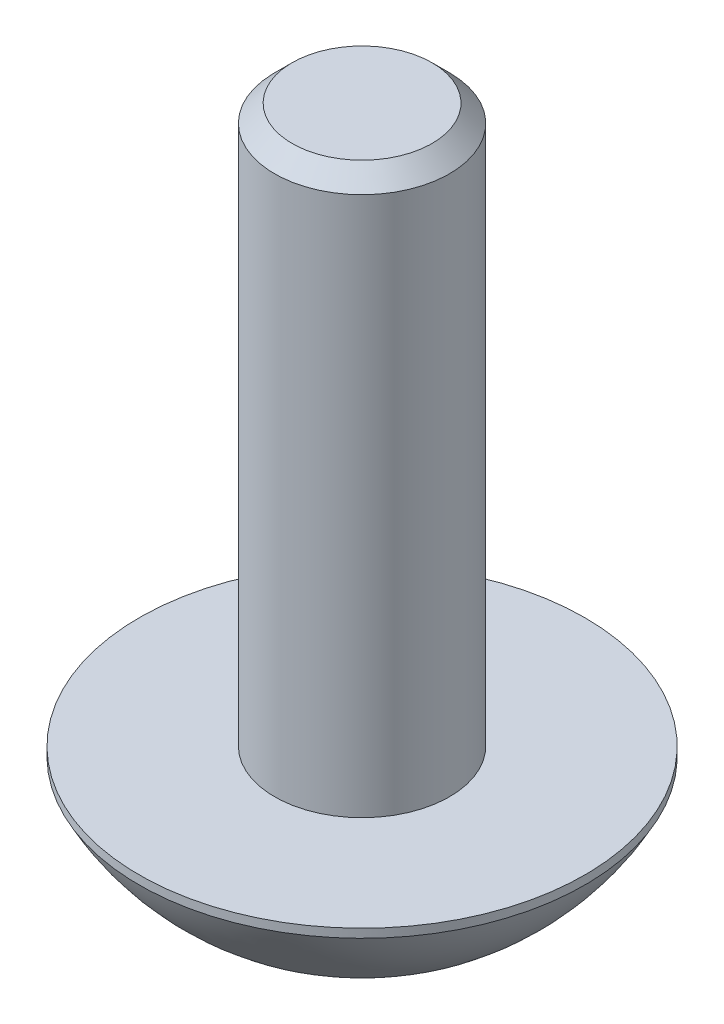
ISO-10303-21;
HEADER;
FILE_DESCRIPTION(('STEP AP214'),'2;1');
FILE_NAME('part.step','',(''),(''),'','','');
FILE_SCHEMA(('AUTOMOTIVE_DESIGN { 1 0 10303 214 1 1 1 1 }'));
ENDSEC;
DATA;
#1=APPLICATION_CONTEXT('core data for automotive mechanical design processes');
#2=APPLICATION_PROTOCOL_DEFINITION('international standard','automotive_design',2000,#1);
#3=PRODUCT_CONTEXT('',#1,'mechanical');
#4=PRODUCT('Part','Part','',(#3));
#5=PRODUCT_RELATED_PRODUCT_CATEGORY('part','',(#4));
#6=PRODUCT_DEFINITION_FORMATION('','',#4);
#7=PRODUCT_DEFINITION_CONTEXT('part definition',#1,'design');
#8=PRODUCT_DEFINITION('design','',#6,#7);
#9=PRODUCT_DEFINITION_SHAPE('','',#8);
#10=(LENGTH_UNIT() NAMED_UNIT(*) SI_UNIT(.MILLI.,.METRE.));
#11=(NAMED_UNIT(*) PLANE_ANGLE_UNIT() SI_UNIT($,.RADIAN.));
#12=(NAMED_UNIT(*) SI_UNIT($,.STERADIAN.) SOLID_ANGLE_UNIT());
#13=UNCERTAINTY_MEASURE_WITH_UNIT(LENGTH_MEASURE(1.E-05),#10,'distance_accuracy_value','');
#14=(GEOMETRIC_REPRESENTATION_CONTEXT(3) GLOBAL_UNCERTAINTY_ASSIGNED_CONTEXT((#13)) GLOBAL_UNIT_ASSIGNED_CONTEXT((#10,
#11,#12)) REPRESENTATION_CONTEXT('',''));
#15=CARTESIAN_POINT('',(0.,0.,0.));
#16=DIRECTION('',(0.,0.,1.));
#17=DIRECTION('',(1.,0.,0.));
#18=AXIS2_PLACEMENT_3D('',#15,#16,#17);
#19=CARTESIAN_POINT('',(0.,0.,0.));
#20=DIRECTION('',(0.,-1.,0.));
#21=DIRECTION('',(0.,0.,-1.));
#22=AXIS2_PLACEMENT_3D('',#19,#20,#21);
#23=CONICAL_SURFACE('',#22,1.44337567297406,0.785398163397444);
#24=CARTESIAN_POINT('',(-1.44349114302788,-0.000115483909116739,0.000200000000000029));
#25=CARTESIAN_POINT('',(-1.41867941875064,0.024678331944914,-0.0427751670715848));
#26=CARTESIAN_POINT('',(-1.39345276980742,0.0480162655813324,-0.0864690047459444));
#27=CARTESIAN_POINT('',(-1.34201263554193,0.0907479959154759,-0.175565930841935));
#28=CARTESIAN_POINT('',(-1.31579425481276,0.110118007639597,-0.220977498357055));
#29=CARTESIAN_POINT('',(-1.26292610442246,0.143299516586531,-0.312547820935247));
#30=CARTESIAN_POINT('',(-1.23628980770471,0.157194440947352,-0.35868324017587));
#31=CARTESIAN_POINT('',(-1.18243062538509,0.178602717839367,-0.451970080407573));
#32=CARTESIAN_POINT('',(-1.15520938653762,0.186132058433219,-0.499118649136358));
#33=CARTESIAN_POINT('',(-1.10829684367468,0.192925501949303,-0.580373556887228));
#34=CARTESIAN_POINT('',(-1.08866617256959,0.193931440895656,-0.614374876627916));
#35=CARTESIAN_POINT('',(-1.04943932800612,0.192238585088687,-0.682317764432452));
#36=CARTESIAN_POINT('',(-1.02984316311601,0.189538972784468,-0.716259317655632));
#37=CARTESIAN_POINT('',(-0.990839954603515,0.180591069683629,-0.783814856457473));
#38=CARTESIAN_POINT('',(-0.971433104248788,0.174339474100301,-0.817428507286748));
#39=CARTESIAN_POINT('',(-0.932943395609924,0.158624318586103,-0.884094638217786));
#40=CARTESIAN_POINT('',(-0.91386068009832,0.149159379912549,-0.917146871030268));
#41=CARTESIAN_POINT('',(-0.864986351354587,0.121068609312421,-1.00179969160024));
#42=CARTESIAN_POINT('',(-0.835502920149093,0.100329842547804,-1.05286649242962));
#43=CARTESIAN_POINT('',(-0.777690319475923,0.0536128653285234,-1.15300085411325));
#44=CARTESIAN_POINT('',(-0.74935774559843,0.0276517040532307,-1.20207431157827));
#45=CARTESIAN_POINT('',(-0.721572366433206,-0.000115483909142432,-1.2502));
#46=B_SPLINE_CURVE_WITH_KNOTS('',3,(#24,#25,#26,#27,#28,#29,#30,#31,#32,#33,#34,#35,#36,#37,#38,
#39,#40,#41,#42,#43,#44,#45),.UNSPECIFIED.,.F.,.F.,(4,2,2,2,2,2,2,2,2,2,4),(0.,
0.166533409618294,0.334037607289743,0.49888039648967,0.663307919240237,0.780963963458787,
0.89864597014841,1.01643764860769,1.13427993171545,1.32148652032138,1.50809158792572),.UNSPECIFIED.);
#47=CARTESIAN_POINT('',(-1.44337567297405,0.,0.));
#48=VERTEX_POINT('',#47);
#49=CARTESIAN_POINT('',(-0.721687836487044,0.,-1.25));
#50=VERTEX_POINT('',#49);
#51=EDGE_CURVE('E166',#48,#50,#46,.T.);
#52=ORIENTED_EDGE('',*,*,#51,.F.);
#53=CARTESIAN_POINT('',(0.,0.,0.));
#54=DIRECTION('',(0.,-1.,0.));
#55=DIRECTION('',(0.,0.,-1.));
#56=AXIS2_PLACEMENT_3D('',#53,#54,#55);
#57=CIRCLE('',#56,1.44337567297406);
#58=EDGE_CURVE('E193',#48,#50,#57,.T.);
#59=ORIENTED_EDGE('',*,*,#58,.T.);
#60=EDGE_LOOP('',(#52,#59));
#61=FACE_BOUND('',#60,.T.);
#62=ADVANCED_FACE('F36',(#61),#23,.F.);
#63=CARTESIAN_POINT('',(0.721687836487012,0.,-1.25000000000001));
#64=VERTEX_POINT('',#63);
#65=EDGE_CURVE('E45',#50,#64,#57,.T.);
#66=ORIENTED_EDGE('',*,*,#65,.T.);
#67=CARTESIAN_POINT('',(-1.50106180814865,-0.510002567890342,-1.25));
#68=CARTESIAN_POINT('',(-1.46477681327301,-0.482123742485892,-1.25));
#69=CARTESIAN_POINT('',(-1.42829653224359,-0.454499885332557,-1.25));
#70=CARTESIAN_POINT('',(-1.35486387340942,-0.399869167895713,-1.25));
#71=CARTESIAN_POINT('',(-1.31791138547806,-0.372862455792127,-1.25));
#72=CARTESIAN_POINT('',(-1.20568289187963,-0.292543110164306,-1.25));
#73=CARTESIAN_POINT('',(-1.12958583069612,-0.240359126269218,-1.25));
#74=CARTESIAN_POINT('',(-0.96960147504813,-0.137329916433619,-1.25));
#75=CARTESIAN_POINT('',(-0.885525180690548,-0.086775069312988,-1.25));
#76=CARTESIAN_POINT('',(-0.71309810326549,0.00610390627588097,-1.25));
#77=CARTESIAN_POINT('',(-0.624763069689417,0.0484558318961502,-1.25));
#78=CARTESIAN_POINT('',(-0.49274791292815,0.100286711171605,-1.25));
#79=CARTESIAN_POINT('',(-0.451154853810598,0.115053650390472,-1.25));
#80=CARTESIAN_POINT('',(-0.366910590050251,0.141254563921419,-1.25));
#81=CARTESIAN_POINT('',(-0.324259317825634,0.152688324765468,-1.25));
#82=CARTESIAN_POINT('',(-0.238897071839322,0.171419001608617,-1.25));
#83=CARTESIAN_POINT('',(-0.196202783515177,0.178790728481284,-1.25));
#84=CARTESIAN_POINT('',(-0.11028908525934,0.189243232640032,-1.25));
#85=CARTESIAN_POINT('',(-0.0670697846069357,0.192324887958122,-1.25));
#86=CARTESIAN_POINT('',(0.0175897516326136,0.193937535162162,-1.25));
#87=CARTESIAN_POINT('',(0.0590263982973039,0.192658896541207,-1.25));
#88=CARTESIAN_POINT('',(0.141573901882158,0.18605726619151,-1.25));
#89=CARTESIAN_POINT('',(0.182684728697025,0.180733905038508,-1.25));
#90=CARTESIAN_POINT('',(0.26498048961027,0.166252973607412,-1.25));
#91=CARTESIAN_POINT('',(0.306153354126642,0.157027896111464,-1.25));
#92=CARTESIAN_POINT('',(0.387590541734934,0.135252291385699,-1.25));
#93=CARTESIAN_POINT('',(0.427854918166971,0.122701959945944,-1.25));
#94=CARTESIAN_POINT('',(0.551957166857683,0.0792263994812403,-1.25));
#95=CARTESIAN_POINT('',(0.634095169246145,0.0434632828567246,-1.25));
#96=CARTESIAN_POINT('',(0.79453346176921,-0.0361180586152603,-1.25));
#97=CARTESIAN_POINT('',(0.872818938610355,-0.0799647004016326,-1.25));
#98=CARTESIAN_POINT('',(1.02246574275315,-0.170495040650415,-1.25));
#99=CARTESIAN_POINT('',(1.09397814240565,-0.21693215814543,-1.25));
#100=CARTESIAN_POINT('',(1.19933658189151,-0.288750290813876,-1.25));
#101=CARTESIAN_POINT('',(1.23400277054524,-0.312949005786241,-1.25));
#102=CARTESIAN_POINT('',(1.30285967699101,-0.361994620499584,-1.25));
#103=CARTESIAN_POINT('',(1.33705052320663,-0.386841339738321,-1.25));
#104=CARTESIAN_POINT('',(1.37104316059689,-0.411957005609356,-1.25));
#105=B_SPLINE_CURVE_WITH_KNOTS('',3,(#67,#68,#69,#70,#71,#72,#73,#74,#75,#76,#77,#78,#79,#80,
#81,#82,#83,#84,#85,#86,#87,#88,#89,#90,#91,#92,#93,#94,#95,#96,#97,#98,#99,#100,#101,#102,#103,
#104),.UNSPECIFIED.,.F.,.F.,(4,2,2,2,2,2,2,2,2,2,2,2,2,2,2,2,2,2,4),(0.,0.137271837086027,
0.274576294752047,0.551274477112475,0.845366809710299,1.13844441548919,1.27074377911261,
1.4030516137748,1.53283350275151,1.66258882587438,1.78675289330408,1.91092830260785,
2.03734624096324,2.16375673751777,2.43173221438948,2.7006683493809,2.95634047817025,
3.08316571971783,3.20995600353242),.UNSPECIFIED.);
#106=EDGE_CURVE('E94',#64,#50,#105,.F.);
#107=ORIENTED_EDGE('',*,*,#106,.T.);
#108=EDGE_LOOP('',(#66,#107));
#109=FACE_BOUND('',#108,.T.);
#110=ADVANCED_FACE('F248',(#109),#23,.F.);
#111=CARTESIAN_POINT('',(-1.50106180814865,-0.510002567890342,1.25));
#112=CARTESIAN_POINT('',(-1.46477681327301,-0.482123742485891,1.25));
#113=CARTESIAN_POINT('',(-1.42829653224359,-0.454499885332556,1.25));
#114=CARTESIAN_POINT('',(-1.35486387340942,-0.399869167895713,1.25));
#115=CARTESIAN_POINT('',(-1.31791138547806,-0.372862455792126,1.25));
#116=CARTESIAN_POINT('',(-1.20568289187963,-0.292543110164305,1.25));
#117=CARTESIAN_POINT('',(-1.12958583069612,-0.240359126269216,1.25));
#118=CARTESIAN_POINT('',(-0.96960147504813,-0.137329916433618,1.25));
#119=CARTESIAN_POINT('',(-0.885525180690549,-0.0867750693129872,1.25));
#120=CARTESIAN_POINT('',(-0.713098103265491,0.00610390627588159,1.25));
#121=CARTESIAN_POINT('',(-0.624763069689417,0.0484558318961508,1.25));
#122=CARTESIAN_POINT('',(-0.492747912928151,0.100286711171606,1.25));
#123=CARTESIAN_POINT('',(-0.451154853810599,0.115053650390473,1.25));
#124=CARTESIAN_POINT('',(-0.366910590050251,0.141254563921419,1.25));
#125=CARTESIAN_POINT('',(-0.324259317825635,0.152688324765469,1.25));
#126=CARTESIAN_POINT('',(-0.238897071839323,0.171419001608618,1.25));
#127=CARTESIAN_POINT('',(-0.196202783515178,0.178790728481285,1.25));
#128=CARTESIAN_POINT('',(-0.110289085259341,0.189243232640033,1.25));
#129=CARTESIAN_POINT('',(-0.0670697846069361,0.192324887958123,1.25));
#130=CARTESIAN_POINT('',(0.0175897516326133,0.193937535162163,1.25));
#131=CARTESIAN_POINT('',(0.0590263982973036,0.192658896541208,1.25));
#132=CARTESIAN_POINT('',(0.141573901882157,0.186057266191511,1.25));
#133=CARTESIAN_POINT('',(0.182684728697025,0.180733905038509,1.25));
#134=CARTESIAN_POINT('',(0.26498048961027,0.166252973607413,1.25));
#135=CARTESIAN_POINT('',(0.306153354126641,0.157027896111465,1.25));
#136=CARTESIAN_POINT('',(0.387590541734933,0.1352522913857,1.25));
#137=CARTESIAN_POINT('',(0.427854918166971,0.122701959945945,1.25));
#138=CARTESIAN_POINT('',(0.551957166857683,0.0792263994812416,1.25));
#139=CARTESIAN_POINT('',(0.634095169246144,0.0434632828567258,1.25));
#140=CARTESIAN_POINT('',(0.794533461769209,-0.0361180586152589,1.25));
#141=CARTESIAN_POINT('',(0.872818938610353,-0.0799647004016309,1.25));
#142=CARTESIAN_POINT('',(1.02246574275315,-0.170495040650413,1.25));
#143=CARTESIAN_POINT('',(1.09397814240564,-0.216932158145429,1.25));
#144=CARTESIAN_POINT('',(1.19933658189151,-0.288750290813874,1.25));
#145=CARTESIAN_POINT('',(1.23400277054524,-0.31294900578624,1.25));
#146=CARTESIAN_POINT('',(1.30285967699101,-0.361994620499582,1.25));
#147=CARTESIAN_POINT('',(1.33705052320663,-0.386841339738319,1.25));
#148=CARTESIAN_POINT('',(1.37104316059689,-0.411957005609354,1.25));
#149=B_SPLINE_CURVE_WITH_KNOTS('',3,(#111,#112,#113,#114,#115,#116,#117,#118,#119,#120,#121,
#122,#123,#124,#125,#126,#127,#128,#129,#130,#131,#132,#133,#134,#135,#136,#137,#138,#139,#140,
#141,#142,#143,#144,#145,#146,#147,#148),.UNSPECIFIED.,.F.,.F.,(4,2,2,2,2,2,2,2,2,2,2,2,2,2,2,2,
2,2,4),(0.,0.137271837086027,0.274576294752047,0.551274477112475,0.845366809710298,
1.13844441548919,1.27074377911261,1.4030516137748,1.53283350275151,1.66258882587438,
1.78675289330408,1.91092830260785,2.03734624096324,2.16375673751777,2.43173221438948,
2.7006683493809,2.95634047817025,3.08316571971783,3.20995600353242),.UNSPECIFIED.);
#150=CARTESIAN_POINT('',(0.721687836487018,0.,1.25));
#151=VERTEX_POINT('',#150);
#152=CARTESIAN_POINT('',(-0.721687836487044,0.,1.25));
#153=VERTEX_POINT('',#152);
#154=EDGE_CURVE('E229',#151,#153,#149,.F.);
#155=ORIENTED_EDGE('',*,*,#154,.F.);
#156=EDGE_CURVE('E203',#151,#153,#57,.T.);
#157=ORIENTED_EDGE('',*,*,#156,.T.);
#158=EDGE_LOOP('',(#155,#157));
#159=FACE_BOUND('',#158,.T.);
#160=ADVANCED_FACE('F252',(#159),#23,.F.);
#161=CARTESIAN_POINT('',(1.44349114302788,-0.000115483909117732,-0.000200000000000325));
#162=CARTESIAN_POINT('',(1.41867941875064,0.0246783319449142,0.0427751670715852));
#163=CARTESIAN_POINT('',(1.39345276980742,0.0480162655813339,0.0864690047459455));
#164=CARTESIAN_POINT('',(1.34201263554193,0.09074799591548,0.175565930841937));
#165=CARTESIAN_POINT('',(1.31579425481275,0.110118007639602,0.220977498357058));
#166=CARTESIAN_POINT('',(1.26292610442245,0.143299516586539,0.312547820935251));
#167=CARTESIAN_POINT('',(1.2362898077047,0.15719444094736,0.358683240175876));
#168=CARTESIAN_POINT('',(1.18243062538507,0.178602717839377,0.45197008040758));
#169=CARTESIAN_POINT('',(1.1552093865376,0.186132058433229,0.499118649136366));
#170=CARTESIAN_POINT('',(1.10829684367466,0.192925501949313,0.580373556887237));
#171=CARTESIAN_POINT('',(1.08866617256957,0.193931440895667,0.614374876627924));
#172=CARTESIAN_POINT('',(1.0494393280061,0.192238585088699,0.682317764432459));
#173=CARTESIAN_POINT('',(1.02984316311599,0.189538972784479,0.716259317655638));
#174=CARTESIAN_POINT('',(0.990839954603495,0.180591069683641,0.783814856457479));
#175=CARTESIAN_POINT('',(0.971433104248768,0.174339474100313,0.817428507286753));
#176=CARTESIAN_POINT('',(0.932943395609903,0.158624318586116,0.88409463821779));
#177=CARTESIAN_POINT('',(0.913860680098299,0.149159379912562,0.917146871030271));
#178=CARTESIAN_POINT('',(0.864986351354565,0.121068609312433,1.00179969160024));
#179=CARTESIAN_POINT('',(0.83550292014907,0.100329842547817,1.05286649242962));
#180=CARTESIAN_POINT('',(0.777690319475899,0.0536128653285368,1.15300085411325));
#181=CARTESIAN_POINT('',(0.749357745598405,0.0276517040532443,1.20207431157827));
#182=CARTESIAN_POINT('',(0.72157236643318,-0.00011548390912878,1.2502));
#183=B_SPLINE_CURVE_WITH_KNOTS('',3,(#161,#162,#163,#164,#165,#166,#167,#168,#169,#170,#171,
#172,#173,#174,#175,#176,#177,#178,#179,#180,#181,#182),.UNSPECIFIED.,.F.,.F.,(4,2,2,2,2,2,2,2,
2,2,4),(0.,0.166533409618299,0.334037607289753,0.498880396489685,0.663307919240257,
0.780963963458806,0.898645970148429,1.01643764860771,1.13427993171546,1.32148652032139,
1.50809158792574),.UNSPECIFIED.);
#184=CARTESIAN_POINT('',(1.44337567297405,0.,0.));
#185=VERTEX_POINT('',#184);
#186=EDGE_CURVE('E138',#185,#151,#183,.T.);
#187=ORIENTED_EDGE('',*,*,#186,.F.);
#188=EDGE_CURVE('E44',#185,#151,#57,.T.);
#189=ORIENTED_EDGE('',*,*,#188,.T.);
#190=EDGE_LOOP('',(#187,#189));
#191=FACE_BOUND('',#190,.T.);
#192=ADVANCED_FACE('F215',(#191),#23,.F.);
#193=EDGE_CURVE('E198',#153,#48,#57,.T.);
#194=ORIENTED_EDGE('',*,*,#193,.T.);
#195=CARTESIAN_POINT('',(-1.44349114302788,-0.000115483909116739,-0.000199999999999971));
#196=CARTESIAN_POINT('',(-1.41867941875064,0.0246783319449139,0.0427751670715848));
#197=CARTESIAN_POINT('',(-1.39345276980742,0.0480162655813324,0.0864690047459444));
#198=CARTESIAN_POINT('',(-1.34201263554193,0.0907479959154762,0.175565930841935));
#199=CARTESIAN_POINT('',(-1.31579425481276,0.110118007639597,0.220977498357055));
#200=CARTESIAN_POINT('',(-1.26292610442246,0.143299516586532,0.312547820935247));
#201=CARTESIAN_POINT('',(-1.23628980770471,0.157194440947352,0.358683240175871));
#202=CARTESIAN_POINT('',(-1.18243062538509,0.178602717839367,0.451970080407573));
#203=CARTESIAN_POINT('',(-1.15520938653762,0.186132058433219,0.499118649136359));
#204=CARTESIAN_POINT('',(-1.10829684367468,0.192925501949303,0.580373556887229));
#205=CARTESIAN_POINT('',(-1.08866617256959,0.193931440895656,0.614374876627917));
#206=CARTESIAN_POINT('',(-1.04943932800612,0.192238585088687,0.682317764432453));
#207=CARTESIAN_POINT('',(-1.02984316311601,0.189538972784468,0.716259317655632));
#208=CARTESIAN_POINT('',(-0.990839954603514,0.180591069683629,0.783814856457474));
#209=CARTESIAN_POINT('',(-0.971433104248787,0.174339474100301,0.817428507286749));
#210=CARTESIAN_POINT('',(-0.932943395609923,0.158624318586103,0.884094638217786));
#211=CARTESIAN_POINT('',(-0.91386068009832,0.149159379912549,0.917146871030268));
#212=CARTESIAN_POINT('',(-0.864986351354586,0.121068609312421,1.00179969160024));
#213=CARTESIAN_POINT('',(-0.835502920149093,0.100329842547804,1.05286649242962));
#214=CARTESIAN_POINT('',(-0.777690319475923,0.0536128653285238,1.15300085411325));
#215=CARTESIAN_POINT('',(-0.74935774559843,0.0276517040532314,1.20207431157827));
#216=CARTESIAN_POINT('',(-0.721572366433206,-0.000115483909141766,1.2502));
#217=B_SPLINE_CURVE_WITH_KNOTS('',3,(#195,#196,#197,#198,#199,#200,#201,#202,#203,#204,#205,
#206,#207,#208,#209,#210,#211,#212,#213,#214,#215,#216),.UNSPECIFIED.,.F.,.F.,(4,2,2,2,2,2,2,2,
2,2,4),(0.,0.166533409618294,0.334037607289743,0.49888039648967,0.663307919240238,
0.780963963458787,0.898645970148411,1.01643764860769,1.13427993171545,1.32148652032138,
1.50809158792572),.UNSPECIFIED.);
#218=EDGE_CURVE('E227',#48,#153,#217,.T.);
#219=ORIENTED_EDGE('',*,*,#218,.T.);
#220=EDGE_LOOP('',(#194,#219));
#221=FACE_BOUND('',#220,.T.);
#222=ADVANCED_FACE('F254',(#221),#23,.F.);
#223=EDGE_CURVE('E11',#64,#185,#57,.T.);
#224=ORIENTED_EDGE('',*,*,#223,.T.);
#225=CARTESIAN_POINT('',(1.44349114302788,-0.000115483909117606,0.000199999999999675));
#226=CARTESIAN_POINT('',(1.41867941875064,0.0246783319449143,-0.0427751670715859));
#227=CARTESIAN_POINT('',(1.39345276980742,0.048016265581334,-0.086469004745946));
#228=CARTESIAN_POINT('',(1.34201263554193,0.0907479959154801,-0.175565930841937));
#229=CARTESIAN_POINT('',(1.31579425481275,0.110118007639602,-0.220977498357058));
#230=CARTESIAN_POINT('',(1.26292610442245,0.143299516586539,-0.312547820935252));
#231=CARTESIAN_POINT('',(1.2362898077047,0.15719444094736,-0.358683240175876));
#232=CARTESIAN_POINT('',(1.18243062538507,0.178602717839377,-0.451970080407581));
#233=CARTESIAN_POINT('',(1.1552093865376,0.186132058433229,-0.499118649136367));
#234=CARTESIAN_POINT('',(1.10829684367466,0.192925501949313,-0.580373556887237));
#235=CARTESIAN_POINT('',(1.08866617256957,0.193931440895666,-0.614374876627925));
#236=CARTESIAN_POINT('',(1.0494393280061,0.192238585088698,-0.682317764432459));
#237=CARTESIAN_POINT('',(1.02984316311599,0.189538972784479,-0.716259317655639));
#238=CARTESIAN_POINT('',(0.990839954603496,0.180591069683641,-0.783814856457479));
#239=CARTESIAN_POINT('',(0.971433104248768,0.174339474100312,-0.817428507286753));
#240=CARTESIAN_POINT('',(0.932943395609904,0.158624318586115,-0.88409463821779));
#241=CARTESIAN_POINT('',(0.913860680098299,0.149159379912561,-0.917146871030272));
#242=CARTESIAN_POINT('',(0.864986351354565,0.121068609312433,-1.00179969160024));
#243=CARTESIAN_POINT('',(0.83550292014907,0.100329842547817,-1.05286649242962));
#244=CARTESIAN_POINT('',(0.777690319475899,0.0536128653285362,-1.15300085411325));
#245=CARTESIAN_POINT('',(0.749357745598405,0.0276517040532436,-1.20207431157827));
#246=CARTESIAN_POINT('',(0.72157236643318,-0.000115483909129643,-1.2502));
#247=B_SPLINE_CURVE_WITH_KNOTS('',3,(#225,#226,#227,#228,#229,#230,#231,#232,#233,#234,#235,
#236,#237,#238,#239,#240,#241,#242,#243,#244,#245,#246),.UNSPECIFIED.,.F.,.F.,(4,2,2,2,2,2,2,2,
2,2,4),(0.,0.166533409618299,0.334037607289752,0.498880396489684,0.663307919240256,
0.780963963458805,0.898645970148428,1.0164376486077,1.13427993171546,1.32148652032139,
1.50809158792574),.UNSPECIFIED.);
#248=EDGE_CURVE('E122',#185,#64,#247,.T.);
#249=ORIENTED_EDGE('',*,*,#248,.T.);
#250=EDGE_LOOP('',(#224,#249));
#251=FACE_BOUND('',#250,.T.);
#252=ADVANCED_FACE('F144',(#251),#23,.F.);
#253=CARTESIAN_POINT('',(1.60042567297406,0.,0.));
#254=DIRECTION('',(0.,1.,0.));
#255=DIRECTION('',(0.,0.,1.));
#256=AXIS2_PLACEMENT_3D('',#253,#254,#255);
#257=PLANE('',#256);
#258=ORIENTED_EDGE('',*,*,#223,.F.);
#259=ORIENTED_EDGE('',*,*,#65,.F.);
#260=ORIENTED_EDGE('',*,*,#58,.F.);
#261=ORIENTED_EDGE('',*,*,#193,.F.);
#262=ORIENTED_EDGE('',*,*,#156,.F.);
#263=ORIENTED_EDGE('',*,*,#188,.F.);
#264=EDGE_LOOP('',(#258,#259,#260,#261,#262,#263));
#265=FACE_BOUND('',#264,.T.);
#266=CARTESIAN_POINT('',(0.,0.,0.));
#267=DIRECTION('',(0.,-1.,0.));
#268=DIRECTION('',(0.,0.,-1.));
#269=AXIS2_PLACEMENT_3D('',#266,#267,#268);
#270=CIRCLE('',#269,1.60042567297406);
#271=CARTESIAN_POINT('',(0.,0.,-1.60042567297406));
#272=VERTEX_POINT('',#271);
#273=EDGE_CURVE('E188',#272,#272,#270,.T.);
#274=ORIENTED_EDGE('',*,*,#273,.T.);
#275=EDGE_LOOP('',(#274));
#276=FACE_BOUND('',#275,.T.);
#277=ADVANCED_FACE('F217',(#265,#276),#257,.F.);
#278=CARTESIAN_POINT('',(0.,4.2070212482292,0.));
#279=DIRECTION('',(0.,-1.,0.));
#280=DIRECTION('',(1.,0.,0.));
#281=AXIS2_PLACEMENT_3D('',#278,#279,#280);
#282=SPHERICAL_SURFACE('',#281,4.50115430948178);
#283=CARTESIAN_POINT('',(0.,2.14295,0.));
#284=DIRECTION('',(0.,-1.,0.));
#285=DIRECTION('',(0.,0.,-1.));
#286=AXIS2_PLACEMENT_3D('',#283,#284,#285);
#287=CIRCLE('',#286,4.);
#288=CARTESIAN_POINT('',(0.,2.14295,-4.));
#289=VERTEX_POINT('',#288);
#290=EDGE_CURVE('E186',#289,#289,#287,.T.);
#291=ORIENTED_EDGE('',*,*,#290,.T.);
#292=EDGE_LOOP('',(#291));
#293=FACE_BOUND('',#292,.T.);
#294=ORIENTED_EDGE('',*,*,#273,.F.);
#295=EDGE_LOOP('',(#294));
#296=FACE_BOUND('',#295,.T.);
#297=ADVANCED_FACE('F259',(#293,#296),#282,.T.);
#298=CARTESIAN_POINT('',(0.,0.,0.));
#299=DIRECTION('',(0.,-1.,0.));
#300=DIRECTION('',(0.,0.,-1.));
#301=AXIS2_PLACEMENT_3D('',#298,#299,#300);
#302=CYLINDRICAL_SURFACE('',#301,4.);
#303=ORIENTED_EDGE('',*,*,#290,.F.);
#304=EDGE_LOOP('',(#303));
#305=FACE_BOUND('',#304,.T.);
#306=CARTESIAN_POINT('',(0.,2.3,0.));
#307=DIRECTION('',(0.,-1.,0.));
#308=DIRECTION('',(0.,0.,-1.));
#309=AXIS2_PLACEMENT_3D('',#306,#307,#308);
#310=CIRCLE('',#309,4.);
#311=CARTESIAN_POINT('',(0.,2.3,-4.));
#312=VERTEX_POINT('',#311);
#313=EDGE_CURVE('E183',#312,#312,#310,.T.);
#314=ORIENTED_EDGE('',*,*,#313,.T.);
#315=EDGE_LOOP('',(#314));
#316=FACE_BOUND('',#315,.T.);
#317=ADVANCED_FACE('F317',(#305,#316),#302,.T.);
#318=CARTESIAN_POINT('',(1.5705,2.3,0.));
#319=DIRECTION('',(0.,-1.,0.));
#320=DIRECTION('',(0.,0.,-1.));
#321=AXIS2_PLACEMENT_3D('',#318,#319,#320);
#322=PLANE('',#321);
#323=ORIENTED_EDGE('',*,*,#313,.F.);
#324=EDGE_LOOP('',(#323));
#325=FACE_BOUND('',#324,.T.);
#326=CARTESIAN_POINT('',(0.,2.3,0.));
#327=DIRECTION('',(0.,-1.,0.));
#328=DIRECTION('',(0.,0.,-1.));
#329=AXIS2_PLACEMENT_3D('',#326,#327,#328);
#330=CIRCLE('',#329,1.5705);
#331=CARTESIAN_POINT('',(0.,2.3,-1.5705));
#332=VERTEX_POINT('',#331);
#333=EDGE_CURVE('E180',#332,#332,#330,.T.);
#334=ORIENTED_EDGE('',*,*,#333,.T.);
#335=EDGE_LOOP('',(#334));
#336=FACE_BOUND('',#335,.T.);
#337=ADVANCED_FACE('F307',(#325,#336),#322,.F.);
#338=CARTESIAN_POINT('',(0.,0.,0.));
#339=DIRECTION('',(0.,-1.,0.));
#340=DIRECTION('',(0.,0.,-1.));
#341=AXIS2_PLACEMENT_3D('',#338,#339,#340);
#342=CYLINDRICAL_SURFACE('',#341,1.5705);
#343=CARTESIAN_POINT('',(0.,11.9859,0.));
#344=DIRECTION('',(0.,-1.,0.));
#345=DIRECTION('',(0.,0.,-1.));
#346=AXIS2_PLACEMENT_3D('',#343,#344,#345);
#347=CIRCLE('',#346,1.5705);
#348=CARTESIAN_POINT('',(0.,11.9859,-1.5705));
#349=VERTEX_POINT('',#348);
#350=EDGE_CURVE('E177',#349,#349,#347,.T.);
#351=ORIENTED_EDGE('',*,*,#350,.T.);
#352=EDGE_LOOP('',(#351));
#353=FACE_BOUND('',#352,.T.);
#354=ORIENTED_EDGE('',*,*,#333,.F.);
#355=EDGE_LOOP('',(#354));
#356=FACE_BOUND('',#355,.T.);
#357=ADVANCED_FACE('F297',(#353,#356),#342,.T.);
#358=CARTESIAN_POINT('',(0.,12.3,0.));
#359=DIRECTION('',(0.,-1.,0.));
#360=DIRECTION('',(0.,0.,-1.));
#361=AXIS2_PLACEMENT_3D('',#358,#359,#360);
#362=CONICAL_SURFACE('',#361,1.2564,0.785398163397442);
#363=ORIENTED_EDGE('',*,*,#350,.F.);
#364=EDGE_LOOP('',(#363));
#365=FACE_BOUND('',#364,.T.);
#366=CARTESIAN_POINT('',(0.,12.3,0.));
#367=DIRECTION('',(0.,-1.,0.));
#368=DIRECTION('',(0.,0.,-1.));
#369=AXIS2_PLACEMENT_3D('',#366,#367,#368);
#370=CIRCLE('',#369,1.2564);
#371=CARTESIAN_POINT('',(0.,12.3,-1.2564));
#372=VERTEX_POINT('',#371);
#373=EDGE_CURVE('E174',#372,#372,#370,.T.);
#374=ORIENTED_EDGE('',*,*,#373,.T.);
#375=EDGE_LOOP('',(#374));
#376=FACE_BOUND('',#375,.T.);
#377=ADVANCED_FACE('F286',(#365,#376),#362,.T.);
#378=CARTESIAN_POINT('',(0.,12.3,0.));
#379=DIRECTION('',(0.,-1.,0.));
#380=DIRECTION('',(0.,0.,-1.));
#381=AXIS2_PLACEMENT_3D('',#378,#379,#380);
#382=PLANE('',#381);
#383=ORIENTED_EDGE('',*,*,#373,.F.);
#384=EDGE_LOOP('',(#383));
#385=FACE_BOUND('',#384,.T.);
#386=ADVANCED_FACE('F157',(#385),#382,.F.);
#387=CARTESIAN_POINT('',(-0.721687836487044,1.4375,-1.25));
#388=DIRECTION('',(0.,-1.,0.));
#389=DIRECTION('',(0.,0.,-1.));
#390=AXIS2_PLACEMENT_3D('',#387,#388,#389);
#391=PLANE('',#390);
#392=DIRECTION('',(1.,0.,0.));
#393=VECTOR('',#392,1.);
#394=CARTESIAN_POINT('',(-0.721687836487044,1.4375,-1.25));
#395=LINE('',#394,#393);
#396=CARTESIAN_POINT('',(-0.721687836487044,1.4375,-1.25));
#397=VERTEX_POINT('',#396);
#398=CARTESIAN_POINT('',(0.721687836487018,1.4375,-1.25));
#399=VERTEX_POINT('',#398);
#400=EDGE_CURVE('E92',#397,#399,#395,.T.);
#401=ORIENTED_EDGE('',*,*,#400,.T.);
#402=DIRECTION('',(0.499999999999998,0.,0.86602540378444));
#403=VECTOR('',#402,1.);
#404=CARTESIAN_POINT('',(0.721687836487018,1.4375,-1.25));
#405=LINE('',#404,#403);
#406=CARTESIAN_POINT('',(1.44337567297405,1.4375,0.));
#407=VERTEX_POINT('',#406);
#408=EDGE_CURVE('E101',#399,#407,#405,.T.);
#409=ORIENTED_EDGE('',*,*,#408,.T.);
#410=DIRECTION('',(0.499999999999998,0.,-0.86602540378444));
#411=VECTOR('',#410,1.);
#412=CARTESIAN_POINT('',(0.721687836487018,1.4375,1.25));
#413=LINE('',#412,#411);
#414=CARTESIAN_POINT('',(0.721687836487018,1.4375,1.25));
#415=VERTEX_POINT('',#414);
#416=EDGE_CURVE('E106',#415,#407,#413,.T.);
#417=ORIENTED_EDGE('',*,*,#416,.F.);
#418=DIRECTION('',(1.,0.,0.));
#419=VECTOR('',#418,1.);
#420=CARTESIAN_POINT('',(-0.721687836487044,1.4375,1.25));
#421=LINE('',#420,#419);
#422=CARTESIAN_POINT('',(-0.721687836487044,1.4375,1.25));
#423=VERTEX_POINT('',#422);
#424=EDGE_CURVE('E115',#423,#415,#421,.T.);
#425=ORIENTED_EDGE('',*,*,#424,.F.);
#426=DIRECTION('',(-0.499999999999984,0.,-0.866025403784448));
#427=VECTOR('',#426,1.);
#428=CARTESIAN_POINT('',(-0.721687836487044,1.4375,1.25));
#429=LINE('',#428,#427);
#430=CARTESIAN_POINT('',(-1.44337567297405,1.4375,0.));
#431=VERTEX_POINT('',#430);
#432=EDGE_CURVE('E117',#423,#431,#429,.T.);
#433=ORIENTED_EDGE('',*,*,#432,.T.);
#434=DIRECTION('',(-0.499999999999984,0.,0.866025403784448));
#435=VECTOR('',#434,1.);
#436=CARTESIAN_POINT('',(-0.721687836487044,1.4375,-1.25));
#437=LINE('',#436,#435);
#438=EDGE_CURVE('E97',#397,#431,#437,.T.);
#439=ORIENTED_EDGE('',*,*,#438,.F.);
#440=EDGE_LOOP('',(#401,#409,#417,#425,#433,#439));
#441=FACE_BOUND('',#440,.T.);
#442=CARTESIAN_POINT('',(0.,1.4375,0.));
#443=DIRECTION('',(0.,-1.,0.));
#444=DIRECTION('',(0.,0.,-1.));
#445=AXIS2_PLACEMENT_3D('',#442,#443,#444);
#446=CIRCLE('',#445,1.2375);
#447=CARTESIAN_POINT('',(0.,1.4375,-1.2375));
#448=VERTEX_POINT('',#447);
#449=EDGE_CURVE('E165',#448,#448,#446,.F.);
#450=ORIENTED_EDGE('',*,*,#449,.T.);
#451=EDGE_LOOP('',(#450));
#452=FACE_BOUND('',#451,.T.);
#453=ADVANCED_FACE('F109',(#441,#452),#391,.T.);
#454=CARTESIAN_POINT('',(-0.721687836487044,1.4375,-1.25));
#455=DIRECTION('',(0.,0.,-1.));
#456=DIRECTION('',(-1.,0.,0.));
#457=AXIS2_PLACEMENT_3D('',#454,#455,#456);
#458=PLANE('',#457);
#459=DIRECTION('',(0.,-1.,0.));
#460=VECTOR('',#459,1.);
#461=CARTESIAN_POINT('',(0.721687836487018,1.4375,-1.25));
#462=LINE('',#461,#460);
#463=EDGE_CURVE('E52',#399,#64,#462,.T.);
#464=ORIENTED_EDGE('',*,*,#463,.F.);
#465=ORIENTED_EDGE('',*,*,#400,.F.);
#466=DIRECTION('',(0.,-1.,0.));
#467=VECTOR('',#466,1.);
#468=CARTESIAN_POINT('',(-0.721687836487044,1.4375,-1.25));
#469=LINE('',#468,#467);
#470=EDGE_CURVE('E120',#397,#50,#469,.T.);
#471=ORIENTED_EDGE('',*,*,#470,.T.);
#472=ORIENTED_EDGE('',*,*,#106,.F.);
#473=EDGE_LOOP('',(#464,#465,#471,#472));
#474=FACE_BOUND('',#473,.T.);
#475=ADVANCED_FACE('F89',(#474),#458,.F.);
#476=CARTESIAN_POINT('',(-0.721687836487044,1.4375,-1.25));
#477=DIRECTION('',(0.866025403784448,0.,0.499999999999984));
#478=DIRECTION('',(0.499999999999984,0.,-0.866025403784448));
#479=AXIS2_PLACEMENT_3D('',#476,#477,#478);
#480=PLANE('',#479);
#481=ORIENTED_EDGE('',*,*,#51,.T.);
#482=ORIENTED_EDGE('',*,*,#470,.F.);
#483=ORIENTED_EDGE('',*,*,#438,.T.);
#484=DIRECTION('',(0.,-1.,0.));
#485=VECTOR('',#484,1.);
#486=CARTESIAN_POINT('',(-1.44337567297405,1.4375,0.));
#487=LINE('',#486,#485);
#488=EDGE_CURVE('E123',#431,#48,#487,.T.);
#489=ORIENTED_EDGE('',*,*,#488,.T.);
#490=EDGE_LOOP('',(#481,#482,#483,#489));
#491=FACE_BOUND('',#490,.T.);
#492=ADVANCED_FACE('F156',(#491),#480,.T.);
#493=CARTESIAN_POINT('',(-0.721687836487044,1.4375,1.25));
#494=DIRECTION('',(-0.866025403784448,0.,0.499999999999984));
#495=DIRECTION('',(0.499999999999984,0.,0.866025403784448));
#496=AXIS2_PLACEMENT_3D('',#493,#494,#495);
#497=PLANE('',#496);
#498=ORIENTED_EDGE('',*,*,#488,.F.);
#499=ORIENTED_EDGE('',*,*,#432,.F.);
#500=DIRECTION('',(0.,-1.,0.));
#501=VECTOR('',#500,1.);
#502=CARTESIAN_POINT('',(-0.721687836487044,1.4375,1.25));
#503=LINE('',#502,#501);
#504=EDGE_CURVE('E126',#423,#153,#503,.T.);
#505=ORIENTED_EDGE('',*,*,#504,.T.);
#506=ORIENTED_EDGE('',*,*,#218,.F.);
#507=EDGE_LOOP('',(#498,#499,#505,#506));
#508=FACE_BOUND('',#507,.T.);
#509=ADVANCED_FACE('F226',(#508),#497,.F.);
#510=CARTESIAN_POINT('',(-0.721687836487044,1.4375,1.25));
#511=DIRECTION('',(0.,0.,-1.));
#512=DIRECTION('',(-1.,0.,0.));
#513=AXIS2_PLACEMENT_3D('',#510,#511,#512);
#514=PLANE('',#513);
#515=ORIENTED_EDGE('',*,*,#154,.T.);
#516=ORIENTED_EDGE('',*,*,#504,.F.);
#517=ORIENTED_EDGE('',*,*,#424,.T.);
#518=DIRECTION('',(0.,-1.,0.));
#519=VECTOR('',#518,1.);
#520=CARTESIAN_POINT('',(0.721687836487018,1.4375,1.25));
#521=LINE('',#520,#519);
#522=EDGE_CURVE('E129',#415,#151,#521,.T.);
#523=ORIENTED_EDGE('',*,*,#522,.T.);
#524=EDGE_LOOP('',(#515,#516,#517,#523));
#525=FACE_BOUND('',#524,.T.);
#526=ADVANCED_FACE('F239',(#525),#514,.T.);
#527=CARTESIAN_POINT('',(0.721687836487018,1.4375,1.25));
#528=DIRECTION('',(-0.86602540378444,0.,-0.499999999999998));
#529=DIRECTION('',(-0.499999999999998,0.,0.86602540378444));
#530=AXIS2_PLACEMENT_3D('',#527,#528,#529);
#531=PLANE('',#530);
#532=ORIENTED_EDGE('',*,*,#186,.T.);
#533=ORIENTED_EDGE('',*,*,#522,.F.);
#534=ORIENTED_EDGE('',*,*,#416,.T.);
#535=DIRECTION('',(0.,-1.,0.));
#536=VECTOR('',#535,1.);
#537=CARTESIAN_POINT('',(1.44337567297405,1.4375,0.));
#538=LINE('',#537,#536);
#539=EDGE_CURVE('E96',#407,#185,#538,.T.);
#540=ORIENTED_EDGE('',*,*,#539,.T.);
#541=EDGE_LOOP('',(#532,#533,#534,#540));
#542=FACE_BOUND('',#541,.T.);
#543=ADVANCED_FACE('F150',(#542),#531,.T.);
#544=CARTESIAN_POINT('',(0.721687836487018,1.4375,-1.25));
#545=DIRECTION('',(0.86602540378444,0.,-0.499999999999998));
#546=DIRECTION('',(-0.499999999999998,0.,-0.86602540378444));
#547=AXIS2_PLACEMENT_3D('',#544,#545,#546);
#548=PLANE('',#547);
#549=ORIENTED_EDGE('',*,*,#539,.F.);
#550=ORIENTED_EDGE('',*,*,#408,.F.);
#551=ORIENTED_EDGE('',*,*,#463,.T.);
#552=ORIENTED_EDGE('',*,*,#248,.F.);
#553=EDGE_LOOP('',(#549,#550,#551,#552));
#554=FACE_BOUND('',#553,.T.);
#555=ADVANCED_FACE('F102',(#554),#548,.F.);
#556=CARTESIAN_POINT('',(0.,1.4375,0.));
#557=DIRECTION('',(0.,-1.,0.));
#558=DIRECTION('',(0.,0.,-1.));
#559=AXIS2_PLACEMENT_3D('',#556,#557,#558);
#560=CONICAL_SURFACE('',#559,1.2375,1.02974425867666);
#561=CARTESIAN_POINT('',(0.,2.1810650160466,0.));
#562=VERTEX_POINT('',#561);
#563=VERTEX_LOOP('',#562);
#564=FACE_BOUND('',#563,.T.);
#565=ORIENTED_EDGE('',*,*,#449,.F.);
#566=EDGE_LOOP('',(#565));
#567=FACE_BOUND('',#566,.T.);
#568=ADVANCED_FACE('F38',(#564,#567),#560,.F.);
#569=CLOSED_SHELL('',(#62,#110,#160,#192,#222,#252,#277,#297,#317,#337,#357,#377,#386,#453,#475,
#492,#509,#526,#543,#555,#568));
#570=MANIFOLD_SOLID_BREP('B2',#569);
#571=ADVANCED_BREP_SHAPE_REPRESENTATION('',(#18,#570),#14);
#572=SHAPE_DEFINITION_REPRESENTATION(#9,#571);
ENDSEC;
END-ISO-10303-21;
